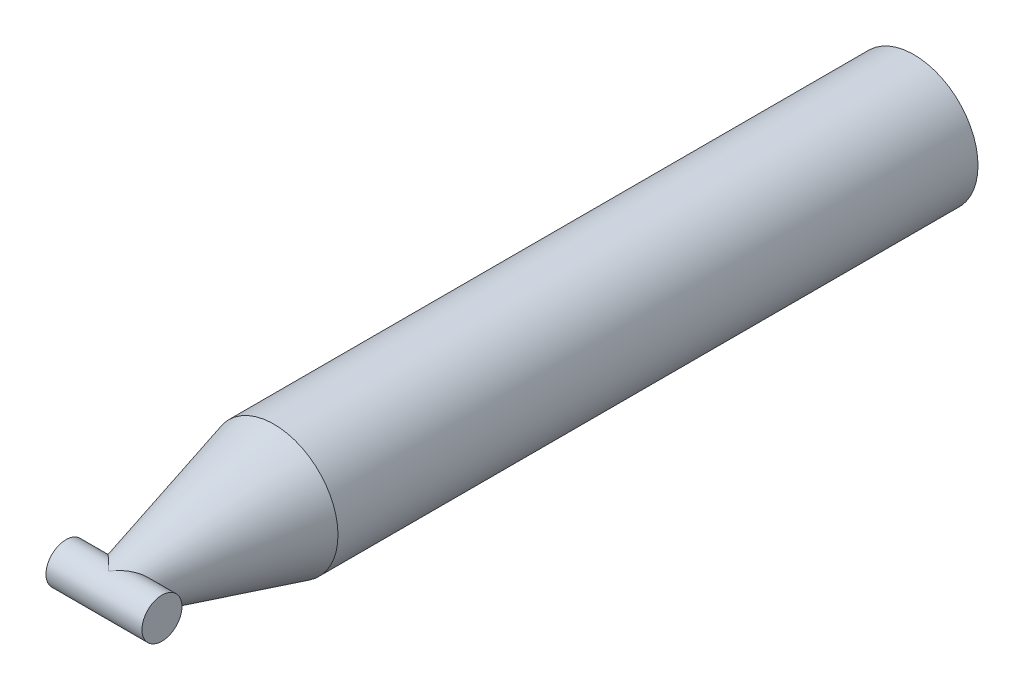
ISO-10303-21;
HEADER;
FILE_DESCRIPTION(('STEP AP214'),'2;1');
FILE_NAME('part.step','',(''),(''),'','','');
FILE_SCHEMA(('AUTOMOTIVE_DESIGN { 1 0 10303 214 1 1 1 1 }'));
ENDSEC;
DATA;
#1=APPLICATION_CONTEXT('core data for automotive mechanical design processes');
#2=APPLICATION_PROTOCOL_DEFINITION('international standard','automotive_design',2000,#1);
#3=PRODUCT_CONTEXT('',#1,'mechanical');
#4=PRODUCT('Part','Part','',(#3));
#5=PRODUCT_RELATED_PRODUCT_CATEGORY('part','',(#4));
#6=PRODUCT_DEFINITION_FORMATION('','',#4);
#7=PRODUCT_DEFINITION_CONTEXT('part definition',#1,'design');
#8=PRODUCT_DEFINITION('design','',#6,#7);
#9=PRODUCT_DEFINITION_SHAPE('','',#8);
#10=(LENGTH_UNIT() NAMED_UNIT(*) SI_UNIT(.MILLI.,.METRE.));
#11=(NAMED_UNIT(*) PLANE_ANGLE_UNIT() SI_UNIT($,.RADIAN.));
#12=(NAMED_UNIT(*) SI_UNIT($,.STERADIAN.) SOLID_ANGLE_UNIT());
#13=UNCERTAINTY_MEASURE_WITH_UNIT(LENGTH_MEASURE(1.E-05),#10,'distance_accuracy_value','');
#14=(GEOMETRIC_REPRESENTATION_CONTEXT(3) GLOBAL_UNCERTAINTY_ASSIGNED_CONTEXT((#13)) GLOBAL_UNIT_ASSIGNED_CONTEXT((#10,
#11,#12)) REPRESENTATION_CONTEXT('',''));
#15=CARTESIAN_POINT('',(0.,0.,0.));
#16=DIRECTION('',(0.,0.,1.));
#17=DIRECTION('',(1.,0.,0.));
#18=AXIS2_PLACEMENT_3D('',#15,#16,#17);
#19=CARTESIAN_POINT('',(0.,0.,-50.));
#20=DIRECTION('',(0.,0.,1.));
#21=DIRECTION('',(1.,0.,0.));
#22=AXIS2_PLACEMENT_3D('',#19,#20,#21);
#23=PLANE('',#22);
#24=CARTESIAN_POINT('',(0.,0.,-50.));
#25=DIRECTION('',(0.,0.,1.));
#26=DIRECTION('',(1.,0.,0.));
#27=AXIS2_PLACEMENT_3D('',#24,#25,#26);
#28=CIRCLE('',#27,8.);
#29=CARTESIAN_POINT('',(8.,0.,-50.));
#30=VERTEX_POINT('',#29);
#31=EDGE_CURVE('E11',#30,#30,#28,.T.);
#32=ORIENTED_EDGE('',*,*,#31,.F.);
#33=EDGE_LOOP('',(#32));
#34=FACE_BOUND('',#33,.T.);
#35=ADVANCED_FACE('F40',(#34),#23,.F.);
#36=CARTESIAN_POINT('',(0.,0.,50.));
#37=DIRECTION('',(0.,0.,1.));
#38=DIRECTION('',(1.,0.,0.));
#39=AXIS2_PLACEMENT_3D('',#36,#37,#38);
#40=CYLINDRICAL_SURFACE('',#39,8.);
#41=CARTESIAN_POINT('',(0.,0.,30.));
#42=DIRECTION('',(0.,0.,1.));
#43=DIRECTION('',(1.,0.,0.));
#44=AXIS2_PLACEMENT_3D('',#41,#42,#43);
#45=CIRCLE('',#44,7.99999999999999);
#46=CARTESIAN_POINT('',(7.99999999999999,0.,30.));
#47=VERTEX_POINT('',#46);
#48=EDGE_CURVE('E47',#47,#47,#45,.T.);
#49=ORIENTED_EDGE('',*,*,#48,.F.);
#50=EDGE_LOOP('',(#49));
#51=FACE_BOUND('',#50,.T.);
#52=ORIENTED_EDGE('',*,*,#31,.T.);
#53=EDGE_LOOP('',(#52));
#54=FACE_BOUND('',#53,.T.);
#55=ADVANCED_FACE('F93',(#51,#54),#40,.T.);
#56=CARTESIAN_POINT('',(0.,0.,30.));
#57=DIRECTION('',(0.,0.,-1.));
#58=DIRECTION('',(-1.,0.,0.));
#59=AXIS2_PLACEMENT_3D('',#56,#57,#58);
#60=CONICAL_SURFACE('',#59,7.99999999999999,0.264184648229388);
#61=CARTESIAN_POINT('',(0.,-2.41326432061796,50.6528057282472));
#62=CARTESIAN_POINT('',(-0.00235695861756334,-2.41387976599249,50.6505305425923));
#63=CARTESIAN_POINT('',(-0.00471443395419639,-2.4144919026364,50.6482548581459));
#64=CARTESIAN_POINT('',(-0.209116439816477,-2.46726824287593,50.4509444310714));
#65=CARTESIAN_POINT('',(-0.41490883038437,-2.49515116589455,50.2522918599663));
#66=CARTESIAN_POINT('',(-0.723847413504586,-2.50156636191738,49.9540716751042));
#67=CARTESIAN_POINT('',(-0.827095684852145,-2.49775562197537,49.8544055262989));
#68=CARTESIAN_POINT('',(-1.03298605382696,-2.47818274413952,49.6556583729373));
#69=CARTESIAN_POINT('',(-1.13562836787111,-2.46242517053405,49.5565771594721));
#70=CARTESIAN_POINT('',(-1.40956257732825,-2.40371915131991,49.292146898224));
#71=CARTESIAN_POINT('',(-1.57973629099558,-2.34954030189872,49.1278772374482));
#72=CARTESIAN_POINT('',(-1.82842665153691,-2.24069954048393,48.8878150078293));
#73=CARTESIAN_POINT('',(-1.91017551995832,-2.19986065956828,48.8089023568939));
#74=CARTESIAN_POINT('',(-2.07081931641421,-2.10853613697529,48.6538319799562));
#75=CARTESIAN_POINT('',(-2.14971555058693,-2.05805497847957,48.5776729931313));
#76=CARTESIAN_POINT('',(-2.33223361963364,-1.92637884809289,48.4014872556488));
#77=CARTESIAN_POINT('',(-2.43422535990837,-1.84072624496019,48.3030340447098));
#78=CARTESIAN_POINT('',(-2.62777906895643,-1.64898482267346,48.1161955406436));
#79=CARTESIAN_POINT('',(-2.71935410745246,-1.54292207213818,48.0277976312387));
#80=CARTESIAN_POINT('',(-2.86733553171798,-1.33727108249822,47.8849503146366));
#81=CARTESIAN_POINT('',(-2.92692767609604,-1.24213507526304,47.8274256763503));
#82=CARTESIAN_POINT('',(-3.03441272346202,-1.03980448677265,47.7236697444438));
#83=CARTESIAN_POINT('',(-3.08232125558602,-0.932626297961155,47.677423363929));
#84=CARTESIAN_POINT('',(-3.15622885592623,-0.72721673836793,47.606079933965));
#85=CARTESIAN_POINT('',(-3.18458146059155,-0.630629868290217,47.5787110022914));
#86=CARTESIAN_POINT('',(-3.22928631875335,-0.432207988716237,47.5355571466288));
#87=CARTESIAN_POINT('',(-3.24564637092968,-0.330376436003768,47.5197646945295));
#88=CARTESIAN_POINT('',(-3.26517665426273,-0.12386967302882,47.500912000143));
#89=CARTESIAN_POINT('',(-3.26829692893487,-0.0191851897585815,47.4978999811367));
#90=CARTESIAN_POINT('',(-3.26094881593014,0.189252848948691,47.5049931567149));
#91=CARTESIAN_POINT('',(-3.2504796525102,0.2930063509009,47.5150991001285));
#92=CARTESIAN_POINT('',(-3.21778105582812,0.490474590567125,47.5466632428107));
#93=CARTESIAN_POINT('',(-3.19626683581689,0.58442287041423,47.5674310426306));
#94=CARTESIAN_POINT('',(-3.14328197667084,0.766683164792154,47.6185776306678));
#95=CARTESIAN_POINT('',(-3.11180742009436,0.854992945226694,47.648960200414));
#96=CARTESIAN_POINT('',(-3.02673695802664,1.05738682733431,47.7310792047859));
#97=CARTESIAN_POINT('',(-2.96928770848546,1.16834355880987,47.7865352945191));
#98=CARTESIAN_POINT('',(-2.84224013522218,1.37588338983976,47.9091750447544));
#99=CARTESIAN_POINT('',(-2.77261749175957,1.47243698570756,47.976382181241));
#100=CARTESIAN_POINT('',(-2.59558507845223,1.68603418276526,48.1472725838258));
#101=CARTESIAN_POINT('',(-2.48402236148487,1.7964015915116,48.2549647136039));
#102=CARTESIAN_POINT('',(-2.24978481421977,1.99128465207581,48.4810755597652));
#103=CARTESIAN_POINT('',(-2.12709058583708,2.07575400666105,48.599513001231));
#104=CARTESIAN_POINT('',(-1.91426739990756,2.1980253647758,48.8049524417244));
#105=CARTESIAN_POINT('',(-1.82597180626259,2.24215801864473,48.8901846840641));
#106=CARTESIAN_POINT('',(-1.64696071818819,2.3196931541194,49.0629851128052));
#107=CARTESIAN_POINT('',(-1.55624427884714,2.35309137747074,49.1505542113352));
#108=CARTESIAN_POINT('',(-1.2815790370672,2.43783510482352,49.4156901425426));
#109=CARTESIAN_POINT('',(-1.09505437441098,2.47376286925324,49.5957434678461));
#110=CARTESIAN_POINT('',(-0.757106663828234,2.5030481209561,49.9219663287919));
#111=CARTESIAN_POINT('',(-0.605937694466945,2.50334542846968,50.0678906009192));
#112=CARTESIAN_POINT('',(-0.304901887955592,2.47844205346545,50.3584821893434));
#113=CARTESIAN_POINT('',(-0.155032771704171,2.45330367010308,50.5031517056702));
#114=CARTESIAN_POINT('',(-0.0047144598394617,2.41449191311039,50.648254833159));
#115=CARTESIAN_POINT('',(-0.00235698461305318,2.41387977659954,50.650530517499));
#116=CARTESIAN_POINT('',(0.,2.41326432061796,50.6528057282472));
#117=B_SPLINE_CURVE_WITH_KNOTS('',3,(#61,#62,#63,#64,#65,#66,#67,#68,#69,#70,#71,#72,#73,#74,
#75,#76,#77,#78,#79,#80,#81,#82,#83,#84,#85,#86,#87,#88,#89,#90,#91,#92,#93,#94,#95,#96,#97,#98,
#99,#100,#101,#102,#103,#104,#105,#106,#107,#108,#109,#110,#111,#112,#113,#114,#115,#116),
.UNSPECIFIED.,.F.,.F.,(4,2,2,2,2,2,2,2,2,2,2,2,2,2,2,2,2,2,2,2,2,2,2,2,2,2,2,4),(0.,
0.0100000051789922,0.866850448202059,1.29717039416066,1.72732601915746,2.45202347918069,
2.81388481310576,3.17557830718425,3.67085808158709,4.16550941480336,4.54259854901381,
4.91918045062312,5.23082070856985,5.54225812864023,5.85486962884787,6.16749897503787,
6.46204644196986,6.75670989992228,7.1645444635685,7.57320329884417,8.14110103771345,
8.71000815050615,9.1007694037886,9.49168547785705,10.2732517939328,10.9022821245372,
11.5297755036102,11.5397755087892),.UNSPECIFIED.);
#118=CARTESIAN_POINT('',(0.,-2.41326432061796,50.6528057282472));
#119=VERTEX_POINT('',#118);
#120=CARTESIAN_POINT('',(0.,2.41326432061796,50.6528057282472));
#121=VERTEX_POINT('',#120);
#122=EDGE_CURVE('E55',#119,#121,#117,.T.);
#123=ORIENTED_EDGE('',*,*,#122,.T.);
#124=CARTESIAN_POINT('',(0.,2.41326432061796,50.6528057282472));
#125=CARTESIAN_POINT('',(0.00235695861756334,2.41387976599249,50.6505305425923));
#126=CARTESIAN_POINT('',(0.00471443395419639,2.4144919026364,50.6482548581459));
#127=CARTESIAN_POINT('',(0.209116439816477,2.46726824287593,50.4509444310714));
#128=CARTESIAN_POINT('',(0.41490883038437,2.49515116589455,50.2522918599663));
#129=CARTESIAN_POINT('',(0.723847413504586,2.50156636191738,49.9540716751042));
#130=CARTESIAN_POINT('',(0.827095684852145,2.49775562197537,49.8544055262989));
#131=CARTESIAN_POINT('',(1.03298605382696,2.47818274413952,49.6556583729373));
#132=CARTESIAN_POINT('',(1.13562836787111,2.46242517053405,49.5565771594721));
#133=CARTESIAN_POINT('',(1.40956257732825,2.40371915131991,49.292146898224));
#134=CARTESIAN_POINT('',(1.57973629099558,2.34954030189872,49.1278772374482));
#135=CARTESIAN_POINT('',(1.82842665153691,2.24069954048393,48.8878150078293));
#136=CARTESIAN_POINT('',(1.91017551995832,2.19986065956828,48.8089023568939));
#137=CARTESIAN_POINT('',(2.07081931641421,2.10853613697529,48.6538319799562));
#138=CARTESIAN_POINT('',(2.14971555058693,2.05805497847957,48.5776729931313));
#139=CARTESIAN_POINT('',(2.33223361963364,1.92637884809289,48.4014872556488));
#140=CARTESIAN_POINT('',(2.43422535990837,1.84072624496019,48.3030340447098));
#141=CARTESIAN_POINT('',(2.62777906895643,1.64898482267346,48.1161955406436));
#142=CARTESIAN_POINT('',(2.71935410745246,1.54292207213818,48.0277976312387));
#143=CARTESIAN_POINT('',(2.86733553171798,1.33727108249822,47.8849503146366));
#144=CARTESIAN_POINT('',(2.92692767609604,1.24213507526304,47.8274256763503));
#145=CARTESIAN_POINT('',(3.03441272346202,1.03980448677265,47.7236697444438));
#146=CARTESIAN_POINT('',(3.08232125558602,0.932626297961155,47.677423363929));
#147=CARTESIAN_POINT('',(3.15622885592623,0.72721673836793,47.606079933965));
#148=CARTESIAN_POINT('',(3.18458146059155,0.630629868290217,47.5787110022914));
#149=CARTESIAN_POINT('',(3.22928631875335,0.432207988716237,47.5355571466288));
#150=CARTESIAN_POINT('',(3.24564637092968,0.330376436003768,47.5197646945295));
#151=CARTESIAN_POINT('',(3.26517665426273,0.12386967302882,47.500912000143));
#152=CARTESIAN_POINT('',(3.26829692893487,0.0191851897585815,47.4978999811367));
#153=CARTESIAN_POINT('',(3.26094881593014,-0.189252848948691,47.5049931567149));
#154=CARTESIAN_POINT('',(3.2504796525102,-0.2930063509009,47.5150991001285));
#155=CARTESIAN_POINT('',(3.21778105582812,-0.490474590567125,47.5466632428107));
#156=CARTESIAN_POINT('',(3.19626683581689,-0.58442287041423,47.5674310426306));
#157=CARTESIAN_POINT('',(3.14328197667084,-0.766683164792154,47.6185776306678));
#158=CARTESIAN_POINT('',(3.11180742009436,-0.854992945226694,47.648960200414));
#159=CARTESIAN_POINT('',(3.02673695802664,-1.05738682733431,47.7310792047859));
#160=CARTESIAN_POINT('',(2.96928770848546,-1.16834355880987,47.7865352945191));
#161=CARTESIAN_POINT('',(2.84224013522218,-1.37588338983976,47.9091750447544));
#162=CARTESIAN_POINT('',(2.77261749175957,-1.47243698570756,47.976382181241));
#163=CARTESIAN_POINT('',(2.59558507845223,-1.68603418276526,48.1472725838258));
#164=CARTESIAN_POINT('',(2.48402236148487,-1.7964015915116,48.2549647136039));
#165=CARTESIAN_POINT('',(2.24978481421977,-1.99128465207581,48.4810755597652));
#166=CARTESIAN_POINT('',(2.12709058583708,-2.07575400666105,48.599513001231));
#167=CARTESIAN_POINT('',(1.91426739990756,-2.1980253647758,48.8049524417244));
#168=CARTESIAN_POINT('',(1.82597180626259,-2.24215801864473,48.8901846840641));
#169=CARTESIAN_POINT('',(1.64696071818819,-2.3196931541194,49.0629851128052));
#170=CARTESIAN_POINT('',(1.55624427884714,-2.35309137747074,49.1505542113352));
#171=CARTESIAN_POINT('',(1.2815790370672,-2.43783510482352,49.4156901425426));
#172=CARTESIAN_POINT('',(1.09505437441098,-2.47376286925324,49.5957434678461));
#173=CARTESIAN_POINT('',(0.757106663828234,-2.5030481209561,49.9219663287919));
#174=CARTESIAN_POINT('',(0.605937694466945,-2.50334542846968,50.0678906009192));
#175=CARTESIAN_POINT('',(0.304901887955592,-2.47844205346545,50.3584821893434));
#176=CARTESIAN_POINT('',(0.155032771704171,-2.45330367010308,50.5031517056702));
#177=CARTESIAN_POINT('',(0.0047144598394617,-2.41449191311039,50.648254833159));
#178=CARTESIAN_POINT('',(0.00235698461305318,-2.41387977659954,50.650530517499));
#179=CARTESIAN_POINT('',(0.,-2.41326432061796,50.6528057282472));
#180=B_SPLINE_CURVE_WITH_KNOTS('',3,(#124,#125,#126,#127,#128,#129,#130,#131,#132,#133,#134,
#135,#136,#137,#138,#139,#140,#141,#142,#143,#144,#145,#146,#147,#148,#149,#150,#151,#152,#153,
#154,#155,#156,#157,#158,#159,#160,#161,#162,#163,#164,#165,#166,#167,#168,#169,#170,#171,#172,
#173,#174,#175,#176,#177,#178,#179),.UNSPECIFIED.,.F.,.F.,(4,2,2,2,2,2,2,2,2,2,2,2,2,2,2,2,2,2,
2,2,2,2,2,2,2,2,2,4),(0.,0.0100000051789922,0.866850448202059,1.29717039416066,1.72732601915746,
2.45202347918069,2.81388481310576,3.17557830718425,3.67085808158709,4.16550941480336,
4.54259854901381,4.91918045062312,5.23082070856985,5.54225812864023,5.85486962884787,
6.16749897503787,6.46204644196986,6.75670989992228,7.1645444635685,7.57320329884417,
8.14110103771345,8.71000815050615,9.1007694037886,9.49168547785705,10.2732517939328,
10.9022821245372,11.5297755036102,11.5397755087892),.UNSPECIFIED.);
#181=EDGE_CURVE('E53',#121,#119,#180,.T.);
#182=ORIENTED_EDGE('',*,*,#181,.T.);
#183=EDGE_LOOP('',(#123,#182));
#184=FACE_BOUND('',#183,.T.);
#185=ORIENTED_EDGE('',*,*,#48,.T.);
#186=EDGE_LOOP('',(#185));
#187=FACE_BOUND('',#186,.T.);
#188=ADVANCED_FACE('F61',(#184,#187),#60,.T.);
#189=CARTESIAN_POINT('',(-6.,0.,50.));
#190=DIRECTION('',(1.,0.,0.));
#191=DIRECTION('',(0.,0.,-1.));
#192=AXIS2_PLACEMENT_3D('',#189,#190,#191);
#193=CYLINDRICAL_SURFACE('',#192,2.5);
#194=CARTESIAN_POINT('',(6.,0.,50.));
#195=DIRECTION('',(1.,0.,0.));
#196=DIRECTION('',(0.,0.,-1.));
#197=AXIS2_PLACEMENT_3D('',#194,#195,#196);
#198=CIRCLE('',#197,2.5);
#199=CARTESIAN_POINT('',(6.,0.,47.5));
#200=VERTEX_POINT('',#199);
#201=EDGE_CURVE('E148',#200,#200,#198,.T.);
#202=ORIENTED_EDGE('',*,*,#201,.F.);
#203=EDGE_LOOP('',(#202));
#204=FACE_BOUND('',#203,.T.);
#205=ORIENTED_EDGE('',*,*,#181,.F.);
#206=ORIENTED_EDGE('',*,*,#122,.F.);
#207=EDGE_LOOP('',(#205,#206));
#208=FACE_BOUND('',#207,.T.);
#209=CARTESIAN_POINT('',(-6.,0.,50.));
#210=DIRECTION('',(1.,0.,0.));
#211=DIRECTION('',(0.,0.,-1.));
#212=AXIS2_PLACEMENT_3D('',#209,#210,#211);
#213=CIRCLE('',#212,2.5);
#214=CARTESIAN_POINT('',(-6.,0.,47.5));
#215=VERTEX_POINT('',#214);
#216=EDGE_CURVE('E59',#215,#215,#213,.T.);
#217=ORIENTED_EDGE('',*,*,#216,.T.);
#218=EDGE_LOOP('',(#217));
#219=FACE_BOUND('',#218,.T.);
#220=ADVANCED_FACE('F56',(#204,#208,#219),#193,.T.);
#221=CARTESIAN_POINT('',(-6.,0.,50.));
#222=DIRECTION('',(1.,0.,0.));
#223=DIRECTION('',(0.,0.,-1.));
#224=AXIS2_PLACEMENT_3D('',#221,#222,#223);
#225=PLANE('',#224);
#226=ORIENTED_EDGE('',*,*,#216,.F.);
#227=EDGE_LOOP('',(#226));
#228=FACE_BOUND('',#227,.T.);
#229=ADVANCED_FACE('F80',(#228),#225,.F.);
#230=CARTESIAN_POINT('',(6.,0.,50.));
#231=DIRECTION('',(1.,0.,0.));
#232=DIRECTION('',(0.,0.,-1.));
#233=AXIS2_PLACEMENT_3D('',#230,#231,#232);
#234=PLANE('',#233);
#235=ORIENTED_EDGE('',*,*,#201,.T.);
#236=EDGE_LOOP('',(#235));
#237=FACE_BOUND('',#236,.T.);
#238=ADVANCED_FACE('F85',(#237),#234,.T.);
#239=CLOSED_SHELL('',(#35,#55,#188,#220,#229,#238));
#240=MANIFOLD_SOLID_BREP('B2',#239);
#241=ADVANCED_BREP_SHAPE_REPRESENTATION('',(#18,#240),#14);
#242=SHAPE_DEFINITION_REPRESENTATION(#9,#241);
ENDSEC;
END-ISO-10303-21;
